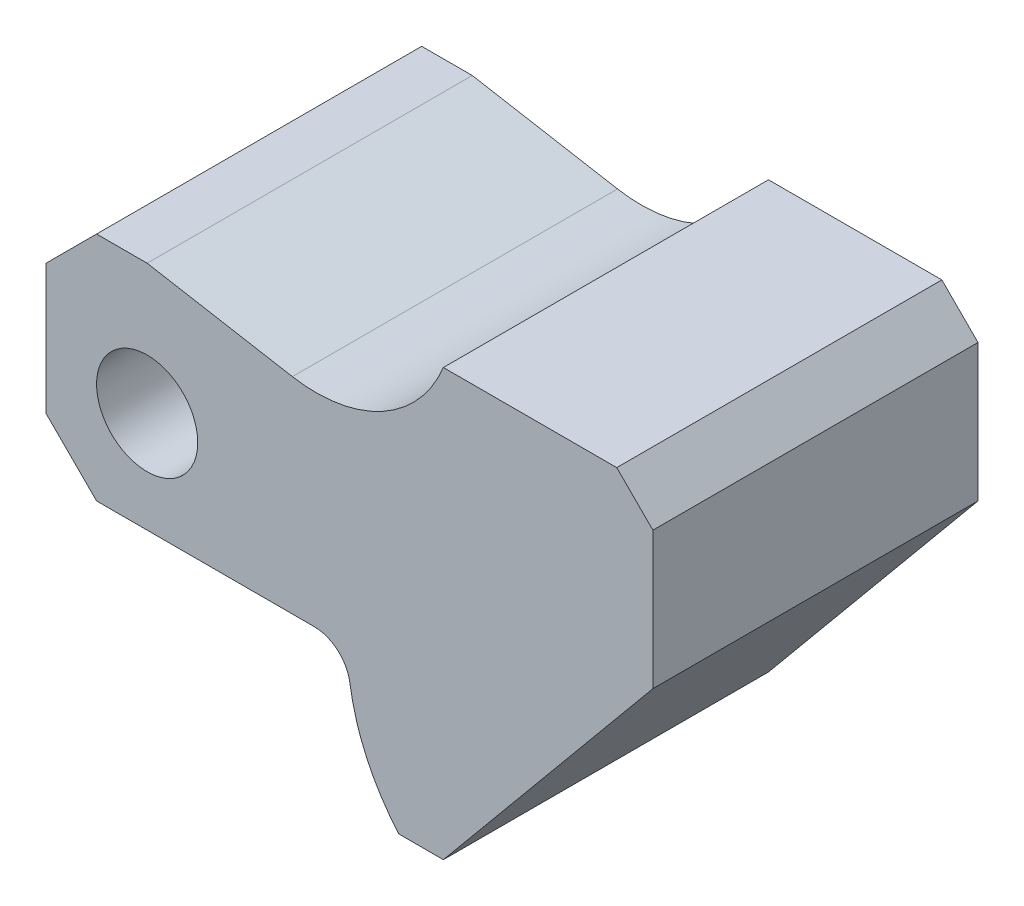
ISO-10303-21;
HEADER;
FILE_DESCRIPTION(('STEP AP214'),'2;1');
FILE_NAME('part.step','',(''),(''),'','','');
FILE_SCHEMA(('AUTOMOTIVE_DESIGN { 1 0 10303 214 1 1 1 1 }'));
ENDSEC;
DATA;
#1=APPLICATION_CONTEXT('core data for automotive mechanical design processes');
#2=APPLICATION_PROTOCOL_DEFINITION('international standard','automotive_design',2000,#1);
#3=PRODUCT_CONTEXT('',#1,'mechanical');
#4=PRODUCT('Part','Part','',(#3));
#5=PRODUCT_RELATED_PRODUCT_CATEGORY('part','',(#4));
#6=PRODUCT_DEFINITION_FORMATION('','',#4);
#7=PRODUCT_DEFINITION_CONTEXT('part definition',#1,'design');
#8=PRODUCT_DEFINITION('design','',#6,#7);
#9=PRODUCT_DEFINITION_SHAPE('','',#8);
#10=(LENGTH_UNIT() NAMED_UNIT(*) SI_UNIT(.MILLI.,.METRE.));
#11=(NAMED_UNIT(*) PLANE_ANGLE_UNIT() SI_UNIT($,.RADIAN.));
#12=(NAMED_UNIT(*) SI_UNIT($,.STERADIAN.) SOLID_ANGLE_UNIT());
#13=UNCERTAINTY_MEASURE_WITH_UNIT(LENGTH_MEASURE(1.E-05),#10,'distance_accuracy_value','');
#14=(GEOMETRIC_REPRESENTATION_CONTEXT(3) GLOBAL_UNCERTAINTY_ASSIGNED_CONTEXT((#13)) GLOBAL_UNIT_ASSIGNED_CONTEXT((#10,
#11,#12)) REPRESENTATION_CONTEXT('',''));
#15=CARTESIAN_POINT('',(0.,0.,0.));
#16=DIRECTION('',(0.,0.,1.));
#17=DIRECTION('',(1.,0.,0.));
#18=AXIS2_PLACEMENT_3D('',#15,#16,#17);
#19=CARTESIAN_POINT('',(0.,0.,-45.));
#20=DIRECTION('',(0.,-1.,0.));
#21=DIRECTION('',(0.,0.,-1.));
#22=AXIS2_PLACEMENT_3D('',#19,#20,#21);
#23=PLANE('',#22);
#24=DIRECTION('',(1.,0.,0.));
#25=VECTOR('',#24,1.);
#26=CARTESIAN_POINT('',(0.,0.,0.));
#27=LINE('',#26,#25);
#28=CARTESIAN_POINT('',(-6.16604515734953,0.,0.));
#29=VERTEX_POINT('',#28);
#30=CARTESIAN_POINT('',(0.,0.,0.));
#31=VERTEX_POINT('',#30);
#32=EDGE_CURVE('E172',#29,#31,#27,.T.);
#33=ORIENTED_EDGE('',*,*,#32,.F.);
#34=DIRECTION('',(0.,0.,1.));
#35=VECTOR('',#34,1.);
#36=CARTESIAN_POINT('',(-6.16604515734953,0.,-45.));
#37=LINE('',#36,#35);
#38=CARTESIAN_POINT('',(-6.16604515734953,0.,-45.));
#39=VERTEX_POINT('',#38);
#40=EDGE_CURVE('E11',#39,#29,#37,.T.);
#41=ORIENTED_EDGE('',*,*,#40,.F.);
#42=DIRECTION('',(1.,0.,0.));
#43=VECTOR('',#42,1.);
#44=CARTESIAN_POINT('',(0.,0.,-45.));
#45=LINE('',#44,#43);
#46=CARTESIAN_POINT('',(0.,0.,-45.));
#47=VERTEX_POINT('',#46);
#48=EDGE_CURVE('E211',#39,#47,#45,.T.);
#49=ORIENTED_EDGE('',*,*,#48,.T.);
#50=DIRECTION('',(0.,0.,1.));
#51=VECTOR('',#50,1.);
#52=CARTESIAN_POINT('',(0.,0.,-45.));
#53=LINE('',#52,#51);
#54=EDGE_CURVE('E42',#47,#31,#53,.T.);
#55=ORIENTED_EDGE('',*,*,#54,.T.);
#56=EDGE_LOOP('',(#33,#41,#49,#55));
#57=FACE_BOUND('',#56,.T.);
#58=ADVANCED_FACE('F39',(#57),#23,.T.);
#59=CARTESIAN_POINT('',(15.7428571428571,19.,-45.));
#60=DIRECTION('',(0.,0.,1.));
#61=DIRECTION('',(1.,0.,0.));
#62=AXIS2_PLACEMENT_3D('',#59,#60,#61);
#63=CYLINDRICAL_SURFACE('',#62,29.);
#64=CARTESIAN_POINT('',(15.7428571428571,19.,0.));
#65=DIRECTION('',(0.,0.,1.));
#66=DIRECTION('',(1.,0.,0.));
#67=AXIS2_PLACEMENT_3D('',#64,#65,#66);
#68=CIRCLE('',#67,29.);
#69=CARTESIAN_POINT('',(-12.9418475573315,14.735294117647,0.));
#70=VERTEX_POINT('',#69);
#71=EDGE_CURVE('E209',#70,#29,#68,.T.);
#72=ORIENTED_EDGE('',*,*,#71,.F.);
#73=DIRECTION('',(0.,0.,1.));
#74=VECTOR('',#73,1.);
#75=CARTESIAN_POINT('',(-12.9418475573315,14.735294117647,-45.));
#76=LINE('',#75,#74);
#77=CARTESIAN_POINT('',(-12.9418475573315,14.735294117647,-45.));
#78=VERTEX_POINT('',#77);
#79=EDGE_CURVE('E48',#78,#70,#76,.T.);
#80=ORIENTED_EDGE('',*,*,#79,.F.);
#81=CARTESIAN_POINT('',(15.7428571428571,19.,-45.));
#82=DIRECTION('',(0.,0.,1.));
#83=DIRECTION('',(1.,0.,0.));
#84=AXIS2_PLACEMENT_3D('',#81,#82,#83);
#85=CIRCLE('',#84,29.);
#86=EDGE_CURVE('E162',#78,#39,#85,.T.);
#87=ORIENTED_EDGE('',*,*,#86,.T.);
#88=ORIENTED_EDGE('',*,*,#40,.T.);
#89=EDGE_LOOP('',(#72,#80,#87,#88));
#90=FACE_BOUND('',#89,.T.);
#91=ADVANCED_FACE('F235',(#90),#63,.T.);
#92=CARTESIAN_POINT('',(-17.8874862987433,14.,-45.));
#93=DIRECTION('',(0.,0.,1.));
#94=DIRECTION('',(1.,0.,0.));
#95=AXIS2_PLACEMENT_3D('',#92,#93,#94);
#96=CYLINDRICAL_SURFACE('',#95,5.);
#97=CARTESIAN_POINT('',(-17.8874862987433,14.,0.));
#98=DIRECTION('',(0.,0.,-1.));
#99=DIRECTION('',(1.,0.,0.));
#100=AXIS2_PLACEMENT_3D('',#97,#98,#99);
#101=CIRCLE('',#100,5.);
#102=CARTESIAN_POINT('',(-17.8874862987433,19.,0.));
#103=VERTEX_POINT('',#102);
#104=EDGE_CURVE('E149',#103,#70,#101,.T.);
#105=ORIENTED_EDGE('',*,*,#104,.F.);
#106=DIRECTION('',(0.,0.,1.));
#107=VECTOR('',#106,1.);
#108=CARTESIAN_POINT('',(-17.8874862987433,19.,-45.));
#109=LINE('',#108,#107);
#110=CARTESIAN_POINT('',(-17.8874862987433,19.,-45.));
#111=VERTEX_POINT('',#110);
#112=EDGE_CURVE('E144',#111,#103,#109,.T.);
#113=ORIENTED_EDGE('',*,*,#112,.F.);
#114=CARTESIAN_POINT('',(-17.8874862987433,14.,-45.));
#115=DIRECTION('',(0.,0.,-1.));
#116=DIRECTION('',(1.,0.,0.));
#117=AXIS2_PLACEMENT_3D('',#114,#115,#116);
#118=CIRCLE('',#117,5.);
#119=EDGE_CURVE('E147',#111,#78,#118,.T.);
#120=ORIENTED_EDGE('',*,*,#119,.T.);
#121=ORIENTED_EDGE('',*,*,#79,.T.);
#122=EDGE_LOOP('',(#105,#113,#120,#121));
#123=FACE_BOUND('',#122,.T.);
#124=ADVANCED_FACE('F146',(#123),#96,.F.);
#125=CARTESIAN_POINT('',(-48.,19.,-45.));
#126=DIRECTION('',(0.,-1.,0.));
#127=DIRECTION('',(1.,0.,0.));
#128=AXIS2_PLACEMENT_3D('',#125,#126,#127);
#129=PLANE('',#128);
#130=DIRECTION('',(1.,0.,0.));
#131=VECTOR('',#130,1.);
#132=CARTESIAN_POINT('',(-48.,19.,0.));
#133=LINE('',#132,#131);
#134=CARTESIAN_POINT('',(-48.,19.,0.));
#135=VERTEX_POINT('',#134);
#136=EDGE_CURVE('E206',#135,#103,#133,.T.);
#137=ORIENTED_EDGE('',*,*,#136,.F.);
#138=DIRECTION('',(0.,0.,1.));
#139=VECTOR('',#138,1.);
#140=CARTESIAN_POINT('',(-48.,19.,-45.));
#141=LINE('',#140,#139);
#142=CARTESIAN_POINT('',(-48.,19.,-45.));
#143=VERTEX_POINT('',#142);
#144=EDGE_CURVE('E154',#143,#135,#141,.T.);
#145=ORIENTED_EDGE('',*,*,#144,.F.);
#146=DIRECTION('',(1.,0.,0.));
#147=VECTOR('',#146,1.);
#148=CARTESIAN_POINT('',(-48.,19.,-45.));
#149=LINE('',#148,#147);
#150=EDGE_CURVE('E160',#143,#111,#149,.T.);
#151=ORIENTED_EDGE('',*,*,#150,.T.);
#152=ORIENTED_EDGE('',*,*,#112,.T.);
#153=EDGE_LOOP('',(#137,#145,#151,#152));
#154=FACE_BOUND('',#153,.T.);
#155=ADVANCED_FACE('F164',(#154),#129,.T.);
#156=CARTESIAN_POINT('',(-48.,19.,-45.));
#157=DIRECTION('',(-0.707106781186548,-0.707106781186547,0.));
#158=DIRECTION('',(0.707106781186547,-0.707106781186548,0.));
#159=AXIS2_PLACEMENT_3D('',#156,#157,#158);
#160=PLANE('',#159);
#161=DIRECTION('',(0.707106781186547,-0.707106781186548,0.));
#162=VECTOR('',#161,1.);
#163=CARTESIAN_POINT('',(-48.,19.,0.));
#164=LINE('',#163,#162);
#165=CARTESIAN_POINT('',(-55.,26.,0.));
#166=VERTEX_POINT('',#165);
#167=EDGE_CURVE('E203',#166,#135,#164,.T.);
#168=ORIENTED_EDGE('',*,*,#167,.F.);
#169=DIRECTION('',(0.,0.,1.));
#170=VECTOR('',#169,1.);
#171=CARTESIAN_POINT('',(-55.,26.,-45.));
#172=LINE('',#171,#170);
#173=CARTESIAN_POINT('',(-55.,26.,-45.));
#174=VERTEX_POINT('',#173);
#175=EDGE_CURVE('E215',#174,#166,#172,.T.);
#176=ORIENTED_EDGE('',*,*,#175,.F.);
#177=DIRECTION('',(0.707106781186547,-0.707106781186548,0.));
#178=VECTOR('',#177,1.);
#179=CARTESIAN_POINT('',(-48.,19.,-45.));
#180=LINE('',#179,#178);
#181=EDGE_CURVE('E165',#174,#143,#180,.T.);
#182=ORIENTED_EDGE('',*,*,#181,.T.);
#183=ORIENTED_EDGE('',*,*,#144,.T.);
#184=EDGE_LOOP('',(#168,#176,#182,#183));
#185=FACE_BOUND('',#184,.T.);
#186=ADVANCED_FACE('F248',(#185),#160,.T.);
#187=CARTESIAN_POINT('',(-55.,26.,-45.));
#188=DIRECTION('',(-1.,0.,0.));
#189=DIRECTION('',(0.,-1.,0.));
#190=AXIS2_PLACEMENT_3D('',#187,#188,#189);
#191=PLANE('',#190);
#192=DIRECTION('',(0.,-1.,0.));
#193=VECTOR('',#192,1.);
#194=CARTESIAN_POINT('',(-55.,26.,0.));
#195=LINE('',#194,#193);
#196=CARTESIAN_POINT('',(-55.,44.,0.));
#197=VERTEX_POINT('',#196);
#198=EDGE_CURVE('E200',#197,#166,#195,.T.);
#199=ORIENTED_EDGE('',*,*,#198,.F.);
#200=DIRECTION('',(0.,0.,1.));
#201=VECTOR('',#200,1.);
#202=CARTESIAN_POINT('',(-55.,44.,-45.));
#203=LINE('',#202,#201);
#204=CARTESIAN_POINT('',(-55.,44.,-45.));
#205=VERTEX_POINT('',#204);
#206=EDGE_CURVE('E217',#205,#197,#203,.T.);
#207=ORIENTED_EDGE('',*,*,#206,.F.);
#208=DIRECTION('',(0.,-1.,0.));
#209=VECTOR('',#208,1.);
#210=CARTESIAN_POINT('',(-55.,26.,-45.));
#211=LINE('',#210,#209);
#212=EDGE_CURVE('E167',#205,#174,#211,.T.);
#213=ORIENTED_EDGE('',*,*,#212,.T.);
#214=ORIENTED_EDGE('',*,*,#175,.T.);
#215=EDGE_LOOP('',(#199,#207,#213,#214));
#216=FACE_BOUND('',#215,.T.);
#217=ADVANCED_FACE('F251',(#216),#191,.T.);
#218=CARTESIAN_POINT('',(-55.,44.,-45.));
#219=DIRECTION('',(-0.707106781186547,0.707106781186548,0.));
#220=DIRECTION('',(-0.707106781186548,-0.707106781186547,0.));
#221=AXIS2_PLACEMENT_3D('',#218,#219,#220);
#222=PLANE('',#221);
#223=DIRECTION('',(-0.707106781186548,-0.707106781186547,0.));
#224=VECTOR('',#223,1.);
#225=CARTESIAN_POINT('',(-55.,44.,0.));
#226=LINE('',#225,#224);
#227=CARTESIAN_POINT('',(-48.,51.,0.));
#228=VERTEX_POINT('',#227);
#229=EDGE_CURVE('E197',#228,#197,#226,.T.);
#230=ORIENTED_EDGE('',*,*,#229,.F.);
#231=DIRECTION('',(0.,0.,1.));
#232=VECTOR('',#231,1.);
#233=CARTESIAN_POINT('',(-48.,51.,-45.));
#234=LINE('',#233,#232);
#235=CARTESIAN_POINT('',(-48.,51.,-45.));
#236=VERTEX_POINT('',#235);
#237=EDGE_CURVE('E219',#236,#228,#234,.T.);
#238=ORIENTED_EDGE('',*,*,#237,.F.);
#239=DIRECTION('',(-0.707106781186548,-0.707106781186547,0.));
#240=VECTOR('',#239,1.);
#241=CARTESIAN_POINT('',(-55.,44.,-45.));
#242=LINE('',#241,#240);
#243=EDGE_CURVE('E328',#236,#205,#242,.T.);
#244=ORIENTED_EDGE('',*,*,#243,.T.);
#245=ORIENTED_EDGE('',*,*,#206,.T.);
#246=EDGE_LOOP('',(#230,#238,#244,#245));
#247=FACE_BOUND('',#246,.T.);
#248=ADVANCED_FACE('F255',(#247),#222,.T.);
#249=CARTESIAN_POINT('',(-48.,51.,-45.));
#250=DIRECTION('',(0.,1.,0.));
#251=DIRECTION('',(0.,0.,1.));
#252=AXIS2_PLACEMENT_3D('',#249,#250,#251);
#253=PLANE('',#252);
#254=DIRECTION('',(-1.,0.,0.));
#255=VECTOR('',#254,1.);
#256=CARTESIAN_POINT('',(-48.,51.,0.));
#257=LINE('',#256,#255);
#258=CARTESIAN_POINT('',(-41.,51.,0.));
#259=VERTEX_POINT('',#258);
#260=EDGE_CURVE('E194',#259,#228,#257,.T.);
#261=ORIENTED_EDGE('',*,*,#260,.F.);
#262=DIRECTION('',(0.,0.,1.));
#263=VECTOR('',#262,1.);
#264=CARTESIAN_POINT('',(-41.,51.,-45.));
#265=LINE('',#264,#263);
#266=CARTESIAN_POINT('',(-41.,51.,-45.));
#267=VERTEX_POINT('',#266);
#268=EDGE_CURVE('E221',#267,#259,#265,.T.);
#269=ORIENTED_EDGE('',*,*,#268,.F.);
#270=DIRECTION('',(-1.,0.,0.));
#271=VECTOR('',#270,1.);
#272=CARTESIAN_POINT('',(-48.,51.,-45.));
#273=LINE('',#272,#271);
#274=EDGE_CURVE('E325',#267,#236,#273,.T.);
#275=ORIENTED_EDGE('',*,*,#274,.T.);
#276=ORIENTED_EDGE('',*,*,#237,.T.);
#277=EDGE_LOOP('',(#261,#269,#275,#276));
#278=FACE_BOUND('',#277,.T.);
#279=ADVANCED_FACE('F259',(#278),#253,.T.);
#280=CARTESIAN_POINT('',(-41.,51.,-45.));
#281=DIRECTION('',(0.173648177666931,0.984807753012208,0.));
#282=DIRECTION('',(-0.984807753012208,0.173648177666931,0.));
#283=AXIS2_PLACEMENT_3D('',#280,#281,#282);
#284=PLANE('',#283);
#285=DIRECTION('',(-0.984807753012208,0.173648177666931,0.));
#286=VECTOR('',#285,1.);
#287=CARTESIAN_POINT('',(-41.,51.,0.));
#288=LINE('',#287,#286);
#289=CARTESIAN_POINT('',(-20.8959576479868,47.4551149120344,0.));
#290=VERTEX_POINT('',#289);
#291=EDGE_CURVE('E191',#290,#259,#288,.T.);
#292=ORIENTED_EDGE('',*,*,#291,.F.);
#293=DIRECTION('',(0.,0.,1.));
#294=VECTOR('',#293,1.);
#295=CARTESIAN_POINT('',(-20.8959576479868,47.4551149120344,-45.));
#296=LINE('',#295,#294);
#297=CARTESIAN_POINT('',(-20.8959576479868,47.4551149120344,-45.));
#298=VERTEX_POINT('',#297);
#299=EDGE_CURVE('E223',#298,#290,#296,.T.);
#300=ORIENTED_EDGE('',*,*,#299,.F.);
#301=DIRECTION('',(-0.984807753012208,0.173648177666931,0.));
#302=VECTOR('',#301,1.);
#303=CARTESIAN_POINT('',(-41.,51.,-45.));
#304=LINE('',#303,#302);
#305=EDGE_CURVE('E322',#298,#267,#304,.T.);
#306=ORIENTED_EDGE('',*,*,#305,.T.);
#307=ORIENTED_EDGE('',*,*,#268,.T.);
#308=EDGE_LOOP('',(#292,#300,#306,#307));
#309=FACE_BOUND('',#308,.T.);
#310=ADVANCED_FACE('F263',(#309),#284,.T.);
#311=CARTESIAN_POINT('',(-17.5966422723151,66.1664622192663,-45.));
#312=DIRECTION('',(0.,0.,1.));
#313=DIRECTION('',(1.,0.,0.));
#314=AXIS2_PLACEMENT_3D('',#311,#312,#313);
#315=CYLINDRICAL_SURFACE('',#314,19.);
#316=CARTESIAN_POINT('',(-17.5966422723151,66.1664622192663,0.));
#317=DIRECTION('',(0.,0.,-1.));
#318=DIRECTION('',(1.,0.,0.));
#319=AXIS2_PLACEMENT_3D('',#316,#317,#318);
#320=CIRCLE('',#319,19.);
#321=CARTESIAN_POINT('',(0.,59.,0.));
#322=VERTEX_POINT('',#321);
#323=EDGE_CURVE('E188',#322,#290,#320,.T.);
#324=ORIENTED_EDGE('',*,*,#323,.F.);
#325=DIRECTION('',(0.,0.,1.));
#326=VECTOR('',#325,1.);
#327=CARTESIAN_POINT('',(0.,59.,-45.));
#328=LINE('',#327,#326);
#329=CARTESIAN_POINT('',(0.,59.,-45.));
#330=VERTEX_POINT('',#329);
#331=EDGE_CURVE('E225',#330,#322,#328,.T.);
#332=ORIENTED_EDGE('',*,*,#331,.F.);
#333=CARTESIAN_POINT('',(-17.5966422723151,66.1664622192663,-45.));
#334=DIRECTION('',(0.,0.,-1.));
#335=DIRECTION('',(1.,0.,0.));
#336=AXIS2_PLACEMENT_3D('',#333,#334,#335);
#337=CIRCLE('',#336,19.);
#338=EDGE_CURVE('E319',#330,#298,#337,.T.);
#339=ORIENTED_EDGE('',*,*,#338,.T.);
#340=ORIENTED_EDGE('',*,*,#299,.T.);
#341=EDGE_LOOP('',(#324,#332,#339,#340));
#342=FACE_BOUND('',#341,.T.);
#343=ADVANCED_FACE('F267',(#342),#315,.F.);
#344=CARTESIAN_POINT('',(24.,59.,-45.));
#345=DIRECTION('',(0.,1.,0.));
#346=DIRECTION('',(-1.,0.,0.));
#347=AXIS2_PLACEMENT_3D('',#344,#345,#346);
#348=PLANE('',#347);
#349=DIRECTION('',(-1.,0.,0.));
#350=VECTOR('',#349,1.);
#351=CARTESIAN_POINT('',(24.,59.,0.));
#352=LINE('',#351,#350);
#353=CARTESIAN_POINT('',(24.,59.,0.));
#354=VERTEX_POINT('',#353);
#355=EDGE_CURVE('E185',#354,#322,#352,.T.);
#356=ORIENTED_EDGE('',*,*,#355,.F.);
#357=DIRECTION('',(0.,0.,1.));
#358=VECTOR('',#357,1.);
#359=CARTESIAN_POINT('',(24.,59.,-45.));
#360=LINE('',#359,#358);
#361=CARTESIAN_POINT('',(24.,59.,-45.));
#362=VERTEX_POINT('',#361);
#363=EDGE_CURVE('E227',#362,#354,#360,.T.);
#364=ORIENTED_EDGE('',*,*,#363,.F.);
#365=DIRECTION('',(-1.,0.,0.));
#366=VECTOR('',#365,1.);
#367=CARTESIAN_POINT('',(24.,59.,-45.));
#368=LINE('',#367,#366);
#369=EDGE_CURVE('E316',#362,#330,#368,.T.);
#370=ORIENTED_EDGE('',*,*,#369,.T.);
#371=ORIENTED_EDGE('',*,*,#331,.T.);
#372=EDGE_LOOP('',(#356,#364,#370,#371));
#373=FACE_BOUND('',#372,.T.);
#374=ADVANCED_FACE('F271',(#373),#348,.T.);
#375=CARTESIAN_POINT('',(29.,54.,-45.));
#376=DIRECTION('',(0.707106781186547,0.707106781186548,0.));
#377=DIRECTION('',(-0.707106781186548,0.707106781186547,0.));
#378=AXIS2_PLACEMENT_3D('',#375,#376,#377);
#379=PLANE('',#378);
#380=DIRECTION('',(-0.707106781186548,0.707106781186547,0.));
#381=VECTOR('',#380,1.);
#382=CARTESIAN_POINT('',(29.,54.,0.));
#383=LINE('',#382,#381);
#384=CARTESIAN_POINT('',(29.,54.,0.));
#385=VERTEX_POINT('',#384);
#386=EDGE_CURVE('E182',#385,#354,#383,.T.);
#387=ORIENTED_EDGE('',*,*,#386,.F.);
#388=DIRECTION('',(0.,0.,1.));
#389=VECTOR('',#388,1.);
#390=CARTESIAN_POINT('',(29.,54.,-45.));
#391=LINE('',#390,#389);
#392=CARTESIAN_POINT('',(29.,54.,-45.));
#393=VERTEX_POINT('',#392);
#394=EDGE_CURVE('E229',#393,#385,#391,.T.);
#395=ORIENTED_EDGE('',*,*,#394,.F.);
#396=DIRECTION('',(-0.707106781186548,0.707106781186547,0.));
#397=VECTOR('',#396,1.);
#398=CARTESIAN_POINT('',(29.,54.,-45.));
#399=LINE('',#398,#397);
#400=EDGE_CURVE('E313',#393,#362,#399,.T.);
#401=ORIENTED_EDGE('',*,*,#400,.T.);
#402=ORIENTED_EDGE('',*,*,#363,.T.);
#403=EDGE_LOOP('',(#387,#395,#401,#402));
#404=FACE_BOUND('',#403,.T.);
#405=ADVANCED_FACE('F275',(#404),#379,.T.);
#406=CARTESIAN_POINT('',(29.,35.,-45.));
#407=DIRECTION('',(1.,0.,0.));
#408=DIRECTION('',(0.,1.,0.));
#409=AXIS2_PLACEMENT_3D('',#406,#407,#408);
#410=PLANE('',#409);
#411=DIRECTION('',(0.,1.,0.));
#412=VECTOR('',#411,1.);
#413=CARTESIAN_POINT('',(29.,35.,0.));
#414=LINE('',#413,#412);
#415=CARTESIAN_POINT('',(29.,35.,0.));
#416=VERTEX_POINT('',#415);
#417=EDGE_CURVE('E179',#416,#385,#414,.T.);
#418=ORIENTED_EDGE('',*,*,#417,.F.);
#419=DIRECTION('',(0.,0.,1.));
#420=VECTOR('',#419,1.);
#421=CARTESIAN_POINT('',(29.,35.,-45.));
#422=LINE('',#421,#420);
#423=CARTESIAN_POINT('',(29.,35.,-45.));
#424=VERTEX_POINT('',#423);
#425=EDGE_CURVE('E230',#424,#416,#422,.T.);
#426=ORIENTED_EDGE('',*,*,#425,.F.);
#427=DIRECTION('',(0.,1.,0.));
#428=VECTOR('',#427,1.);
#429=CARTESIAN_POINT('',(29.,35.,-45.));
#430=LINE('',#429,#428);
#431=EDGE_CURVE('E310',#424,#393,#430,.T.);
#432=ORIENTED_EDGE('',*,*,#431,.T.);
#433=ORIENTED_EDGE('',*,*,#394,.T.);
#434=EDGE_LOOP('',(#418,#426,#432,#433));
#435=FACE_BOUND('',#434,.T.);
#436=ADVANCED_FACE('F279',(#435),#410,.T.);
#437=CARTESIAN_POINT('',(0.,0.,-45.));
#438=DIRECTION('',(0.770021560905562,-0.638017864750323,0.));
#439=DIRECTION('',(0.638017864750323,0.770021560905562,0.));
#440=AXIS2_PLACEMENT_3D('',#437,#438,#439);
#441=PLANE('',#440);
#442=DIRECTION('',(0.638017864750323,0.770021560905562,0.));
#443=VECTOR('',#442,1.);
#444=CARTESIAN_POINT('',(0.,0.,0.));
#445=LINE('',#444,#443);
#446=EDGE_CURVE('E175',#31,#416,#445,.T.);
#447=ORIENTED_EDGE('',*,*,#446,.F.);
#448=ORIENTED_EDGE('',*,*,#54,.F.);
#449=DIRECTION('',(0.638017864750323,0.770021560905562,0.));
#450=VECTOR('',#449,1.);
#451=CARTESIAN_POINT('',(0.,0.,-45.));
#452=LINE('',#451,#450);
#453=EDGE_CURVE('E308',#47,#424,#452,.T.);
#454=ORIENTED_EDGE('',*,*,#453,.T.);
#455=ORIENTED_EDGE('',*,*,#425,.T.);
#456=EDGE_LOOP('',(#447,#448,#454,#455));
#457=FACE_BOUND('',#456,.T.);
#458=ADVANCED_FACE('F232',(#457),#441,.T.);
#459=CARTESIAN_POINT('',(15.7428571428571,19.,-45.));
#460=DIRECTION('',(0.,0.,1.));
#461=DIRECTION('',(1.,0.,0.));
#462=AXIS2_PLACEMENT_3D('',#459,#460,#461);
#463=PLANE('',#462);
#464=CARTESIAN_POINT('',(-41.,33.,-45.));
#465=DIRECTION('',(0.,0.,1.));
#466=DIRECTION('',(1.,0.,0.));
#467=AXIS2_PLACEMENT_3D('',#464,#465,#466);
#468=CIRCLE('',#467,7.);
#469=CARTESIAN_POINT('',(-34.,33.,-45.));
#470=VERTEX_POINT('',#469);
#471=EDGE_CURVE('E176',#470,#470,#468,.T.);
#472=ORIENTED_EDGE('',*,*,#471,.T.);
#473=EDGE_LOOP('',(#472));
#474=FACE_BOUND('',#473,.T.);
#475=ORIENTED_EDGE('',*,*,#48,.F.);
#476=ORIENTED_EDGE('',*,*,#86,.F.);
#477=ORIENTED_EDGE('',*,*,#119,.F.);
#478=ORIENTED_EDGE('',*,*,#150,.F.);
#479=ORIENTED_EDGE('',*,*,#181,.F.);
#480=ORIENTED_EDGE('',*,*,#212,.F.);
#481=ORIENTED_EDGE('',*,*,#243,.F.);
#482=ORIENTED_EDGE('',*,*,#274,.F.);
#483=ORIENTED_EDGE('',*,*,#305,.F.);
#484=ORIENTED_EDGE('',*,*,#338,.F.);
#485=ORIENTED_EDGE('',*,*,#369,.F.);
#486=ORIENTED_EDGE('',*,*,#400,.F.);
#487=ORIENTED_EDGE('',*,*,#431,.F.);
#488=ORIENTED_EDGE('',*,*,#453,.F.);
#489=EDGE_LOOP('',(#475,#476,#477,#478,#479,#480,#481,#482,#483,#484,#485,#486,#487,#488));
#490=FACE_BOUND('',#489,.T.);
#491=ADVANCED_FACE('F158',(#474,#490),#463,.F.);
#492=CARTESIAN_POINT('',(15.7428571428571,19.,0.));
#493=DIRECTION('',(0.,0.,1.));
#494=DIRECTION('',(1.,0.,0.));
#495=AXIS2_PLACEMENT_3D('',#492,#493,#494);
#496=PLANE('',#495);
#497=CARTESIAN_POINT('',(-41.,33.,0.));
#498=DIRECTION('',(0.,0.,1.));
#499=DIRECTION('',(1.,0.,0.));
#500=AXIS2_PLACEMENT_3D('',#497,#498,#499);
#501=CIRCLE('',#500,7.);
#502=CARTESIAN_POINT('',(-34.,33.,0.));
#503=VERTEX_POINT('',#502);
#504=EDGE_CURVE('E303',#503,#503,#501,.T.);
#505=ORIENTED_EDGE('',*,*,#504,.F.);
#506=EDGE_LOOP('',(#505));
#507=FACE_BOUND('',#506,.T.);
#508=ORIENTED_EDGE('',*,*,#32,.T.);
#509=ORIENTED_EDGE('',*,*,#446,.T.);
#510=ORIENTED_EDGE('',*,*,#417,.T.);
#511=ORIENTED_EDGE('',*,*,#386,.T.);
#512=ORIENTED_EDGE('',*,*,#355,.T.);
#513=ORIENTED_EDGE('',*,*,#323,.T.);
#514=ORIENTED_EDGE('',*,*,#291,.T.);
#515=ORIENTED_EDGE('',*,*,#260,.T.);
#516=ORIENTED_EDGE('',*,*,#229,.T.);
#517=ORIENTED_EDGE('',*,*,#198,.T.);
#518=ORIENTED_EDGE('',*,*,#167,.T.);
#519=ORIENTED_EDGE('',*,*,#136,.T.);
#520=ORIENTED_EDGE('',*,*,#104,.T.);
#521=ORIENTED_EDGE('',*,*,#71,.T.);
#522=EDGE_LOOP('',(#508,#509,#510,#511,#512,#513,#514,#515,#516,#517,#518,#519,#520,#521));
#523=FACE_BOUND('',#522,.T.);
#524=ADVANCED_FACE('F234',(#507,#523),#496,.T.);
#525=CARTESIAN_POINT('',(-41.,33.,-45.));
#526=DIRECTION('',(0.,0.,1.));
#527=DIRECTION('',(1.,0.,0.));
#528=AXIS2_PLACEMENT_3D('',#525,#526,#527);
#529=CYLINDRICAL_SURFACE('',#528,7.);
#530=ORIENTED_EDGE('',*,*,#471,.F.);
#531=EDGE_LOOP('',(#530));
#532=FACE_BOUND('',#531,.T.);
#533=ORIENTED_EDGE('',*,*,#504,.T.);
#534=EDGE_LOOP('',(#533));
#535=FACE_BOUND('',#534,.T.);
#536=ADVANCED_FACE('F291',(#532,#535),#529,.F.);
#537=CLOSED_SHELL('',(#58,#91,#124,#155,#186,#217,#248,#279,#310,#343,#374,#405,#436,#458,#491,
#524,#536));
#538=MANIFOLD_SOLID_BREP('B2',#537);
#539=ADVANCED_BREP_SHAPE_REPRESENTATION('',(#18,#538),#14);
#540=SHAPE_DEFINITION_REPRESENTATION(#9,#539);
ENDSEC;
END-ISO-10303-21;
